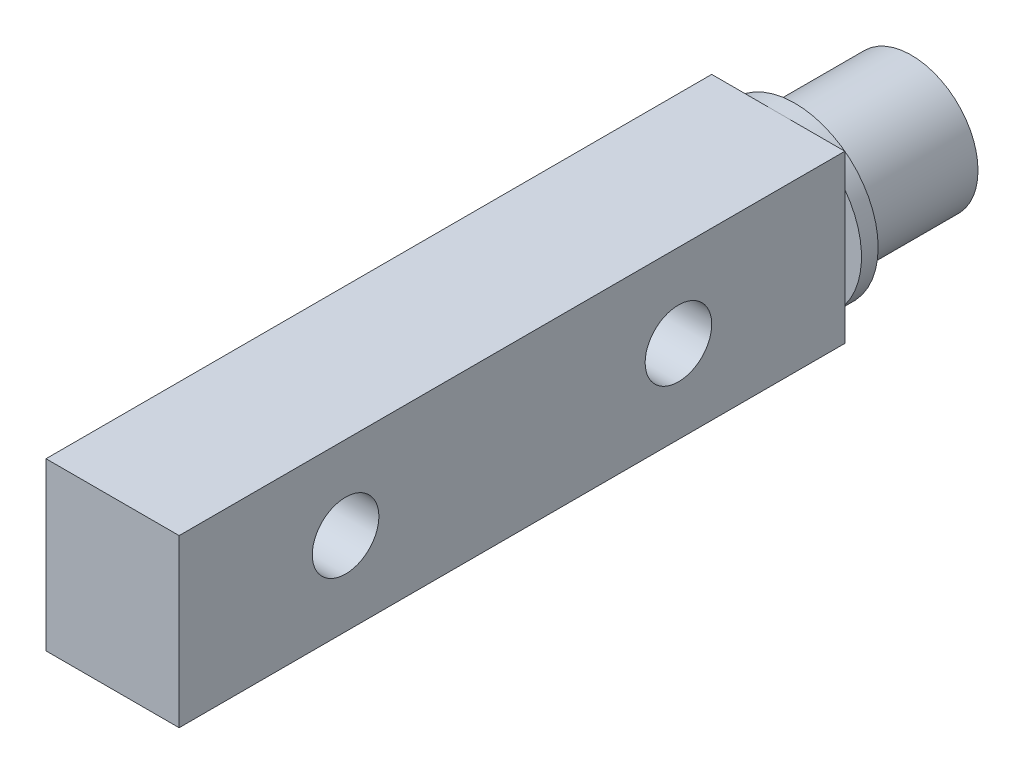
ISO-10303-21;
HEADER;
FILE_DESCRIPTION(('STEP AP214'),'2;1');
FILE_NAME('part.step','',(''),(''),'','','');
FILE_SCHEMA(('AUTOMOTIVE_DESIGN { 1 0 10303 214 1 1 1 1 }'));
ENDSEC;
DATA;
#1=APPLICATION_CONTEXT('core data for automotive mechanical design processes');
#2=APPLICATION_PROTOCOL_DEFINITION('international standard','automotive_design',2000,#1);
#3=PRODUCT_CONTEXT('',#1,'mechanical');
#4=PRODUCT('Part','Part','',(#3));
#5=PRODUCT_RELATED_PRODUCT_CATEGORY('part','',(#4));
#6=PRODUCT_DEFINITION_FORMATION('','',#4);
#7=PRODUCT_DEFINITION_CONTEXT('part definition',#1,'design');
#8=PRODUCT_DEFINITION('design','',#6,#7);
#9=PRODUCT_DEFINITION_SHAPE('','',#8);
#10=(LENGTH_UNIT() NAMED_UNIT(*) SI_UNIT(.MILLI.,.METRE.));
#11=(NAMED_UNIT(*) PLANE_ANGLE_UNIT() SI_UNIT($,.RADIAN.));
#12=(NAMED_UNIT(*) SI_UNIT($,.STERADIAN.) SOLID_ANGLE_UNIT());
#13=UNCERTAINTY_MEASURE_WITH_UNIT(LENGTH_MEASURE(1.E-05),#10,'distance_accuracy_value','');
#14=(GEOMETRIC_REPRESENTATION_CONTEXT(3) GLOBAL_UNCERTAINTY_ASSIGNED_CONTEXT((#13)) GLOBAL_UNIT_ASSIGNED_CONTEXT((#10,
#11,#12)) REPRESENTATION_CONTEXT('',''));
#15=CARTESIAN_POINT('',(0.,0.,0.));
#16=DIRECTION('',(0.,0.,1.));
#17=DIRECTION('',(1.,0.,0.));
#18=AXIS2_PLACEMENT_3D('',#15,#16,#17);
#19=CARTESIAN_POINT('',(0.,0.,8.));
#20=DIRECTION('',(0.,0.,1.));
#21=DIRECTION('',(1.,0.,0.));
#22=AXIS2_PLACEMENT_3D('',#19,#20,#21);
#23=PLANE('',#22);
#24=DIRECTION('',(0.,-1.,0.));
#25=VECTOR('',#24,1.);
#26=CARTESIAN_POINT('',(-4.,5.,8.));
#27=LINE('',#26,#25);
#28=CARTESIAN_POINT('',(-4.,3.,8.));
#29=VERTEX_POINT('',#28);
#30=CARTESIAN_POINT('',(-4.,-3.,8.));
#31=VERTEX_POINT('',#30);
#32=EDGE_CURVE('E11',#29,#31,#27,.T.);
#33=ORIENTED_EDGE('',*,*,#32,.F.);
#34=CARTESIAN_POINT('',(0.,0.,8.));
#35=DIRECTION('',(0.,0.,1.));
#36=DIRECTION('',(1.,0.,0.));
#37=AXIS2_PLACEMENT_3D('',#34,#35,#36);
#38=CIRCLE('',#37,5.);
#39=EDGE_CURVE('E346',#29,#31,#38,.T.);
#40=ORIENTED_EDGE('',*,*,#39,.T.);
#41=EDGE_LOOP('',(#33,#40));
#42=FACE_BOUND('',#41,.T.);
#43=ADVANCED_FACE('F35',(#42),#23,.T.);
#44=CARTESIAN_POINT('',(0.,0.,7.));
#45=DIRECTION('',(0.,0.,-1.));
#46=DIRECTION('',(-1.,0.,0.));
#47=AXIS2_PLACEMENT_3D('',#44,#45,#46);
#48=CYLINDRICAL_SURFACE('',#47,4.);
#49=CARTESIAN_POINT('',(0.,0.,7.));
#50=DIRECTION('',(0.,0.,1.));
#51=DIRECTION('',(1.,0.,0.));
#52=AXIS2_PLACEMENT_3D('',#49,#50,#51);
#53=CIRCLE('',#52,4.);
#54=CARTESIAN_POINT('',(4.,0.,7.));
#55=VERTEX_POINT('',#54);
#56=EDGE_CURVE('E136',#55,#55,#53,.T.);
#57=ORIENTED_EDGE('',*,*,#56,.F.);
#58=EDGE_LOOP('',(#57));
#59=FACE_BOUND('',#58,.T.);
#60=CARTESIAN_POINT('',(0.,0.,0.));
#61=DIRECTION('',(0.,0.,1.));
#62=DIRECTION('',(1.,0.,0.));
#63=AXIS2_PLACEMENT_3D('',#60,#61,#62);
#64=CIRCLE('',#63,4.);
#65=CARTESIAN_POINT('',(4.,0.,0.));
#66=VERTEX_POINT('',#65);
#67=EDGE_CURVE('E39',#66,#66,#64,.T.);
#68=ORIENTED_EDGE('',*,*,#67,.T.);
#69=EDGE_LOOP('',(#68));
#70=FACE_BOUND('',#69,.T.);
#71=ADVANCED_FACE('F37',(#59,#70),#48,.T.);
#72=CARTESIAN_POINT('',(0.,0.,0.));
#73=DIRECTION('',(0.,0.,1.));
#74=DIRECTION('',(1.,0.,0.));
#75=AXIS2_PLACEMENT_3D('',#72,#73,#74);
#76=PLANE('',#75);
#77=ORIENTED_EDGE('',*,*,#67,.F.);
#78=EDGE_LOOP('',(#77));
#79=FACE_BOUND('',#78,.T.);
#80=ADVANCED_FACE('F147',(#79),#76,.F.);
#81=CARTESIAN_POINT('',(0.,0.,8.));
#82=DIRECTION('',(0.,0.,-1.));
#83=DIRECTION('',(-1.,0.,0.));
#84=AXIS2_PLACEMENT_3D('',#81,#82,#83);
#85=CYLINDRICAL_SURFACE('',#84,5.);
#86=CARTESIAN_POINT('',(4.,3.,8.));
#87=VERTEX_POINT('',#86);
#88=CARTESIAN_POINT('',(0.,5.,8.));
#89=VERTEX_POINT('',#88);
#90=EDGE_CURVE('E133',#87,#89,#38,.T.);
#91=ORIENTED_EDGE('',*,*,#90,.F.);
#92=CARTESIAN_POINT('',(4.,-3.,8.));
#93=VERTEX_POINT('',#92);
#94=EDGE_CURVE('E127',#93,#87,#38,.T.);
#95=ORIENTED_EDGE('',*,*,#94,.F.);
#96=CARTESIAN_POINT('',(0.,-5.,8.));
#97=VERTEX_POINT('',#96);
#98=EDGE_CURVE('E59',#97,#93,#38,.T.);
#99=ORIENTED_EDGE('',*,*,#98,.F.);
#100=EDGE_CURVE('E347',#31,#97,#38,.T.);
#101=ORIENTED_EDGE('',*,*,#100,.F.);
#102=ORIENTED_EDGE('',*,*,#39,.F.);
#103=EDGE_CURVE('E135',#89,#29,#38,.T.);
#104=ORIENTED_EDGE('',*,*,#103,.F.);
#105=EDGE_LOOP('',(#91,#95,#99,#101,#102,#104));
#106=FACE_BOUND('',#105,.T.);
#107=CARTESIAN_POINT('',(0.,0.,7.));
#108=DIRECTION('',(0.,0.,1.));
#109=DIRECTION('',(1.,0.,0.));
#110=AXIS2_PLACEMENT_3D('',#107,#108,#109);
#111=CIRCLE('',#110,5.);
#112=CARTESIAN_POINT('',(5.,0.,7.));
#113=VERTEX_POINT('',#112);
#114=EDGE_CURVE('E124',#113,#113,#111,.T.);
#115=ORIENTED_EDGE('',*,*,#114,.T.);
#116=EDGE_LOOP('',(#115));
#117=FACE_BOUND('',#116,.T.);
#118=ADVANCED_FACE('F149',(#106,#117),#85,.T.);
#119=DIRECTION('',(0.,1.,0.));
#120=VECTOR('',#119,1.);
#121=CARTESIAN_POINT('',(4.,5.,8.));
#122=LINE('',#121,#120);
#123=EDGE_CURVE('E44',#93,#87,#122,.T.);
#124=ORIENTED_EDGE('',*,*,#123,.F.);
#125=ORIENTED_EDGE('',*,*,#94,.T.);
#126=EDGE_LOOP('',(#124,#125));
#127=FACE_BOUND('',#126,.T.);
#128=ADVANCED_FACE('F154',(#127),#23,.T.);
#129=CARTESIAN_POINT('',(0.,0.,7.));
#130=DIRECTION('',(0.,0.,1.));
#131=DIRECTION('',(1.,0.,0.));
#132=AXIS2_PLACEMENT_3D('',#129,#130,#131);
#133=PLANE('',#132);
#134=ORIENTED_EDGE('',*,*,#56,.T.);
#135=EDGE_LOOP('',(#134));
#136=FACE_BOUND('',#135,.T.);
#137=ORIENTED_EDGE('',*,*,#114,.F.);
#138=EDGE_LOOP('',(#137));
#139=FACE_BOUND('',#138,.T.);
#140=ADVANCED_FACE('F165',(#136,#139),#133,.F.);
#141=CARTESIAN_POINT('',(0.,0.,8.));
#142=DIRECTION('',(0.,0.,1.));
#143=DIRECTION('',(1.,0.,0.));
#144=AXIS2_PLACEMENT_3D('',#141,#142,#143);
#145=PLANE('',#144);
#146=CARTESIAN_POINT('',(4.,5.,8.));
#147=VERTEX_POINT('',#146);
#148=EDGE_CURVE('E142',#87,#147,#122,.T.);
#149=ORIENTED_EDGE('',*,*,#148,.F.);
#150=ORIENTED_EDGE('',*,*,#90,.T.);
#151=DIRECTION('',(-1.,0.,0.));
#152=VECTOR('',#151,1.);
#153=CARTESIAN_POINT('',(-4.,5.,8.));
#154=LINE('',#153,#152);
#155=EDGE_CURVE('E118',#147,#89,#154,.T.);
#156=ORIENTED_EDGE('',*,*,#155,.F.);
#157=EDGE_LOOP('',(#149,#150,#156));
#158=FACE_BOUND('',#157,.T.);
#159=ADVANCED_FACE('F169',(#158),#145,.F.);
#160=CARTESIAN_POINT('',(-4.,5.,8.));
#161=VERTEX_POINT('',#160);
#162=EDGE_CURVE('E204',#89,#161,#154,.T.);
#163=ORIENTED_EDGE('',*,*,#162,.F.);
#164=ORIENTED_EDGE('',*,*,#103,.T.);
#165=EDGE_CURVE('E46',#161,#29,#27,.T.);
#166=ORIENTED_EDGE('',*,*,#165,.F.);
#167=EDGE_LOOP('',(#163,#164,#166));
#168=FACE_BOUND('',#167,.T.);
#169=ADVANCED_FACE('F173',(#168),#145,.F.);
#170=CARTESIAN_POINT('',(-4.,-5.,8.));
#171=VERTEX_POINT('',#170);
#172=EDGE_CURVE('E47',#31,#171,#27,.T.);
#173=ORIENTED_EDGE('',*,*,#172,.F.);
#174=ORIENTED_EDGE('',*,*,#100,.T.);
#175=DIRECTION('',(1.,0.,0.));
#176=VECTOR('',#175,1.);
#177=CARTESIAN_POINT('',(-4.,-5.,8.));
#178=LINE('',#177,#176);
#179=EDGE_CURVE('E200',#171,#97,#178,.T.);
#180=ORIENTED_EDGE('',*,*,#179,.F.);
#181=EDGE_LOOP('',(#173,#174,#180));
#182=FACE_BOUND('',#181,.T.);
#183=ADVANCED_FACE('F183',(#182),#145,.F.);
#184=CARTESIAN_POINT('',(4.,-5.,8.));
#185=VERTEX_POINT('',#184);
#186=EDGE_CURVE('E198',#97,#185,#178,.T.);
#187=ORIENTED_EDGE('',*,*,#186,.F.);
#188=ORIENTED_EDGE('',*,*,#98,.T.);
#189=EDGE_CURVE('E141',#185,#93,#122,.T.);
#190=ORIENTED_EDGE('',*,*,#189,.F.);
#191=EDGE_LOOP('',(#187,#188,#190));
#192=FACE_BOUND('',#191,.T.);
#193=ADVANCED_FACE('F176',(#192),#145,.F.);
#194=CARTESIAN_POINT('',(-4.,5.,48.));
#195=DIRECTION('',(1.,0.,0.));
#196=DIRECTION('',(0.,1.,0.));
#197=AXIS2_PLACEMENT_3D('',#194,#195,#196);
#198=PLANE('',#197);
#199=CARTESIAN_POINT('',(-4.,0.,38.));
#200=DIRECTION('',(-1.,0.,0.));
#201=DIRECTION('',(0.,-1.,0.));
#202=AXIS2_PLACEMENT_3D('',#199,#200,#201);
#203=CIRCLE('',#202,2.);
#204=CARTESIAN_POINT('',(-4.,-2.,38.));
#205=VERTEX_POINT('',#204);
#206=EDGE_CURVE('E241',#205,#205,#203,.T.);
#207=ORIENTED_EDGE('',*,*,#206,.F.);
#208=EDGE_LOOP('',(#207));
#209=FACE_BOUND('',#208,.T.);
#210=CARTESIAN_POINT('',(-4.,0.,18.));
#211=DIRECTION('',(-1.,0.,0.));
#212=DIRECTION('',(0.,-1.,0.));
#213=AXIS2_PLACEMENT_3D('',#210,#211,#212);
#214=CIRCLE('',#213,2.);
#215=CARTESIAN_POINT('',(-4.,-2.,18.));
#216=VERTEX_POINT('',#215);
#217=EDGE_CURVE('E219',#216,#216,#214,.T.);
#218=ORIENTED_EDGE('',*,*,#217,.F.);
#219=EDGE_LOOP('',(#218));
#220=FACE_BOUND('',#219,.T.);
#221=ORIENTED_EDGE('',*,*,#165,.T.);
#222=ORIENTED_EDGE('',*,*,#32,.T.);
#223=ORIENTED_EDGE('',*,*,#172,.T.);
#224=DIRECTION('',(0.,0.,-1.));
#225=VECTOR('',#224,1.);
#226=CARTESIAN_POINT('',(-4.,-5.,48.));
#227=LINE('',#226,#225);
#228=CARTESIAN_POINT('',(-4.,-5.,48.));
#229=VERTEX_POINT('',#228);
#230=EDGE_CURVE('E103',#229,#171,#227,.T.);
#231=ORIENTED_EDGE('',*,*,#230,.F.);
#232=DIRECTION('',(0.,-1.,0.));
#233=VECTOR('',#232,1.);
#234=CARTESIAN_POINT('',(-4.,5.,48.));
#235=LINE('',#234,#233);
#236=CARTESIAN_POINT('',(-4.,5.,48.));
#237=VERTEX_POINT('',#236);
#238=EDGE_CURVE('E109',#237,#229,#235,.T.);
#239=ORIENTED_EDGE('',*,*,#238,.F.);
#240=DIRECTION('',(0.,0.,-1.));
#241=VECTOR('',#240,1.);
#242=CARTESIAN_POINT('',(-4.,5.,48.));
#243=LINE('',#242,#241);
#244=EDGE_CURVE('E207',#237,#161,#243,.T.);
#245=ORIENTED_EDGE('',*,*,#244,.T.);
#246=EDGE_LOOP('',(#221,#222,#223,#231,#239,#245));
#247=FACE_BOUND('',#246,.T.);
#248=ADVANCED_FACE('F121',(#209,#220,#247),#198,.F.);
#249=CARTESIAN_POINT('',(-4.,-5.,48.));
#250=DIRECTION('',(0.,1.,0.));
#251=DIRECTION('',(-1.,0.,0.));
#252=AXIS2_PLACEMENT_3D('',#249,#250,#251);
#253=PLANE('',#252);
#254=ORIENTED_EDGE('',*,*,#179,.T.);
#255=ORIENTED_EDGE('',*,*,#186,.T.);
#256=DIRECTION('',(0.,0.,-1.));
#257=VECTOR('',#256,1.);
#258=CARTESIAN_POINT('',(4.,-5.,48.));
#259=LINE('',#258,#257);
#260=CARTESIAN_POINT('',(4.,-5.,48.));
#261=VERTEX_POINT('',#260);
#262=EDGE_CURVE('E105',#261,#185,#259,.T.);
#263=ORIENTED_EDGE('',*,*,#262,.F.);
#264=DIRECTION('',(1.,0.,0.));
#265=VECTOR('',#264,1.);
#266=CARTESIAN_POINT('',(-4.,-5.,48.));
#267=LINE('',#266,#265);
#268=EDGE_CURVE('E98',#229,#261,#267,.T.);
#269=ORIENTED_EDGE('',*,*,#268,.F.);
#270=ORIENTED_EDGE('',*,*,#230,.T.);
#271=EDGE_LOOP('',(#254,#255,#263,#269,#270));
#272=FACE_BOUND('',#271,.T.);
#273=ADVANCED_FACE('F101',(#272),#253,.F.);
#274=CARTESIAN_POINT('',(4.,5.,48.));
#275=DIRECTION('',(-1.,0.,0.));
#276=DIRECTION('',(0.,0.,1.));
#277=AXIS2_PLACEMENT_3D('',#274,#275,#276);
#278=PLANE('',#277);
#279=CARTESIAN_POINT('',(4.,0.,38.));
#280=DIRECTION('',(-1.,0.,0.));
#281=DIRECTION('',(0.,0.,1.));
#282=AXIS2_PLACEMENT_3D('',#279,#280,#281);
#283=CIRCLE('',#282,2.);
#284=CARTESIAN_POINT('',(4.,0.,40.));
#285=VERTEX_POINT('',#284);
#286=EDGE_CURVE('E224',#285,#285,#283,.F.);
#287=ORIENTED_EDGE('',*,*,#286,.F.);
#288=EDGE_LOOP('',(#287));
#289=FACE_BOUND('',#288,.T.);
#290=CARTESIAN_POINT('',(4.,0.,18.));
#291=DIRECTION('',(-1.,0.,0.));
#292=DIRECTION('',(0.,0.,1.));
#293=AXIS2_PLACEMENT_3D('',#290,#291,#292);
#294=CIRCLE('',#293,2.);
#295=CARTESIAN_POINT('',(4.,0.,20.));
#296=VERTEX_POINT('',#295);
#297=EDGE_CURVE('E217',#296,#296,#294,.F.);
#298=ORIENTED_EDGE('',*,*,#297,.F.);
#299=EDGE_LOOP('',(#298));
#300=FACE_BOUND('',#299,.T.);
#301=ORIENTED_EDGE('',*,*,#189,.T.);
#302=ORIENTED_EDGE('',*,*,#123,.T.);
#303=ORIENTED_EDGE('',*,*,#148,.T.);
#304=DIRECTION('',(0.,0.,-1.));
#305=VECTOR('',#304,1.);
#306=CARTESIAN_POINT('',(4.,5.,48.));
#307=LINE('',#306,#305);
#308=CARTESIAN_POINT('',(4.,5.,48.));
#309=VERTEX_POINT('',#308);
#310=EDGE_CURVE('E129',#309,#147,#307,.T.);
#311=ORIENTED_EDGE('',*,*,#310,.F.);
#312=DIRECTION('',(0.,1.,0.));
#313=VECTOR('',#312,1.);
#314=CARTESIAN_POINT('',(4.,5.,48.));
#315=LINE('',#314,#313);
#316=EDGE_CURVE('E108',#261,#309,#315,.T.);
#317=ORIENTED_EDGE('',*,*,#316,.F.);
#318=ORIENTED_EDGE('',*,*,#262,.T.);
#319=EDGE_LOOP('',(#301,#302,#303,#311,#317,#318));
#320=FACE_BOUND('',#319,.T.);
#321=ADVANCED_FACE('F228',(#289,#300,#320),#278,.F.);
#322=CARTESIAN_POINT('',(-4.,5.,48.));
#323=DIRECTION('',(0.,-1.,0.));
#324=DIRECTION('',(1.,0.,0.));
#325=AXIS2_PLACEMENT_3D('',#322,#323,#324);
#326=PLANE('',#325);
#327=ORIENTED_EDGE('',*,*,#155,.T.);
#328=ORIENTED_EDGE('',*,*,#162,.T.);
#329=ORIENTED_EDGE('',*,*,#244,.F.);
#330=DIRECTION('',(-1.,0.,0.));
#331=VECTOR('',#330,1.);
#332=CARTESIAN_POINT('',(-4.,5.,48.));
#333=LINE('',#332,#331);
#334=EDGE_CURVE('E114',#309,#237,#333,.T.);
#335=ORIENTED_EDGE('',*,*,#334,.F.);
#336=ORIENTED_EDGE('',*,*,#310,.T.);
#337=EDGE_LOOP('',(#327,#328,#329,#335,#336));
#338=FACE_BOUND('',#337,.T.);
#339=ADVANCED_FACE('F212',(#338),#326,.F.);
#340=CARTESIAN_POINT('',(0.,0.,48.));
#341=DIRECTION('',(0.,0.,1.));
#342=DIRECTION('',(1.,0.,0.));
#343=AXIS2_PLACEMENT_3D('',#340,#341,#342);
#344=PLANE('',#343);
#345=ORIENTED_EDGE('',*,*,#238,.T.);
#346=ORIENTED_EDGE('',*,*,#268,.T.);
#347=ORIENTED_EDGE('',*,*,#316,.T.);
#348=ORIENTED_EDGE('',*,*,#334,.T.);
#349=EDGE_LOOP('',(#345,#346,#347,#348));
#350=FACE_BOUND('',#349,.T.);
#351=ADVANCED_FACE('F112',(#350),#344,.T.);
#352=CARTESIAN_POINT('',(5.001,0.,18.));
#353=DIRECTION('',(-1.,0.,0.));
#354=DIRECTION('',(0.,-1.,0.));
#355=AXIS2_PLACEMENT_3D('',#352,#353,#354);
#356=CYLINDRICAL_SURFACE('',#355,2.);
#357=ORIENTED_EDGE('',*,*,#217,.T.);
#358=EDGE_LOOP('',(#357));
#359=FACE_BOUND('',#358,.T.);
#360=ORIENTED_EDGE('',*,*,#297,.T.);
#361=EDGE_LOOP('',(#360));
#362=FACE_BOUND('',#361,.T.);
#363=ADVANCED_FACE('F250',(#359,#362),#356,.F.);
#364=CARTESIAN_POINT('',(5.001,0.,38.));
#365=DIRECTION('',(-1.,0.,0.));
#366=DIRECTION('',(0.,-1.,0.));
#367=AXIS2_PLACEMENT_3D('',#364,#365,#366);
#368=CYLINDRICAL_SURFACE('',#367,2.);
#369=ORIENTED_EDGE('',*,*,#206,.T.);
#370=EDGE_LOOP('',(#369));
#371=FACE_BOUND('',#370,.T.);
#372=ORIENTED_EDGE('',*,*,#286,.T.);
#373=EDGE_LOOP('',(#372));
#374=FACE_BOUND('',#373,.T.);
#375=ADVANCED_FACE('F246',(#371,#374),#368,.F.);
#376=CLOSED_SHELL('',(#43,#71,#80,#118,#128,#140,#159,#169,#183,#193,#248,#273,#321,#339,#351,
#363,#375));
#377=MANIFOLD_SOLID_BREP('B2',#376);
#378=ADVANCED_BREP_SHAPE_REPRESENTATION('',(#18,#377),#14);
#379=SHAPE_DEFINITION_REPRESENTATION(#9,#378);
ENDSEC;
END-ISO-10303-21;
